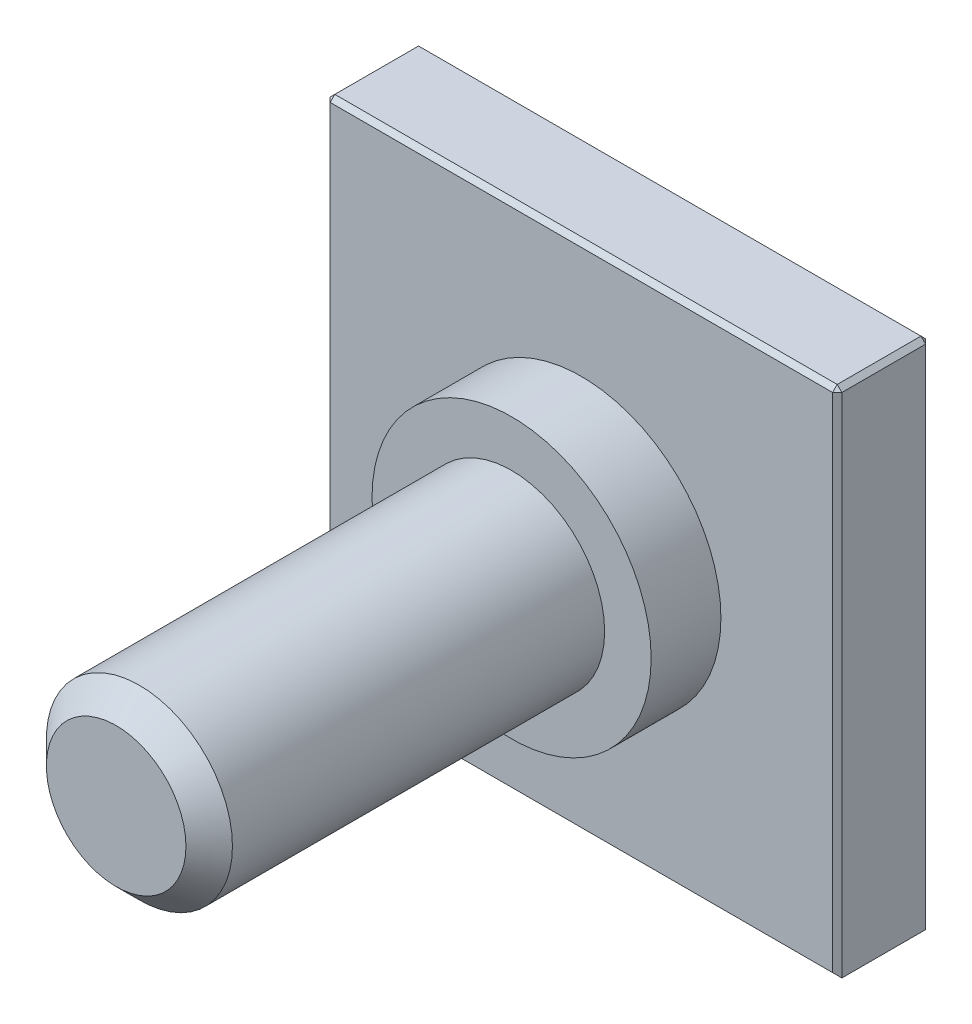
ISO-10303-21;
HEADER;
FILE_DESCRIPTION(('STEP AP214'),'2;1');
FILE_NAME('part.step','',(''),(''),'','','');
FILE_SCHEMA(('AUTOMOTIVE_DESIGN { 1 0 10303 214 1 1 1 1 }'));
ENDSEC;
DATA;
#1=APPLICATION_CONTEXT('core data for automotive mechanical design processes');
#2=APPLICATION_PROTOCOL_DEFINITION('international standard','automotive_design',2000,#1);
#3=PRODUCT_CONTEXT('',#1,'mechanical');
#4=PRODUCT('Part','Part','',(#3));
#5=PRODUCT_RELATED_PRODUCT_CATEGORY('part','',(#4));
#6=PRODUCT_DEFINITION_FORMATION('','',#4);
#7=PRODUCT_DEFINITION_CONTEXT('part definition',#1,'design');
#8=PRODUCT_DEFINITION('design','',#6,#7);
#9=PRODUCT_DEFINITION_SHAPE('','',#8);
#10=(LENGTH_UNIT() NAMED_UNIT(*) SI_UNIT(.MILLI.,.METRE.));
#11=(NAMED_UNIT(*) PLANE_ANGLE_UNIT() SI_UNIT($,.RADIAN.));
#12=(NAMED_UNIT(*) SI_UNIT($,.STERADIAN.) SOLID_ANGLE_UNIT());
#13=UNCERTAINTY_MEASURE_WITH_UNIT(LENGTH_MEASURE(1.E-05),#10,'distance_accuracy_value','');
#14=(GEOMETRIC_REPRESENTATION_CONTEXT(3) GLOBAL_UNCERTAINTY_ASSIGNED_CONTEXT((#13)) GLOBAL_UNIT_ASSIGNED_CONTEXT((#10,
#11,#12)) REPRESENTATION_CONTEXT('',''));
#15=CARTESIAN_POINT('',(0.,0.,0.));
#16=DIRECTION('',(0.,0.,1.));
#17=DIRECTION('',(1.,0.,0.));
#18=AXIS2_PLACEMENT_3D('',#15,#16,#17);
#19=CARTESIAN_POINT('',(5.5,-5.5,2.));
#20=DIRECTION('',(-1.,0.,0.));
#21=DIRECTION('',(0.,0.,1.));
#22=AXIS2_PLACEMENT_3D('',#19,#20,#21);
#23=PLANE('',#22);
#24=DIRECTION('',(0.,0.,-1.));
#25=VECTOR('',#24,1.);
#26=CARTESIAN_POINT('',(5.5,-5.5,2.));
#27=LINE('',#26,#25);
#28=CARTESIAN_POINT('',(5.5,-5.5,1.9));
#29=VERTEX_POINT('',#28);
#30=CARTESIAN_POINT('',(5.5,-5.5,0.100000000000001));
#31=VERTEX_POINT('',#30);
#32=EDGE_CURVE('E167',#29,#31,#27,.T.);
#33=ORIENTED_EDGE('',*,*,#32,.T.);
#34=DIRECTION('',(0.,1.,0.));
#35=VECTOR('',#34,1.);
#36=CARTESIAN_POINT('',(5.5,5.5,0.0999999999999994));
#37=LINE('',#36,#35);
#38=CARTESIAN_POINT('',(5.5,5.4,0.0999999999999994));
#39=VERTEX_POINT('',#38);
#40=EDGE_CURVE('E276',#31,#39,#37,.T.);
#41=ORIENTED_EDGE('',*,*,#40,.T.);
#42=DIRECTION('',(0.,0.,1.));
#43=VECTOR('',#42,1.);
#44=CARTESIAN_POINT('',(5.5,5.4,2.));
#45=LINE('',#44,#43);
#46=CARTESIAN_POINT('',(5.5,5.4,1.9));
#47=VERTEX_POINT('',#46);
#48=EDGE_CURVE('E273',#39,#47,#45,.T.);
#49=ORIENTED_EDGE('',*,*,#48,.T.);
#50=DIRECTION('',(0.,-1.,0.));
#51=VECTOR('',#50,1.);
#52=CARTESIAN_POINT('',(5.5,-5.5,1.9));
#53=LINE('',#52,#51);
#54=EDGE_CURVE('E269',#47,#29,#53,.T.);
#55=ORIENTED_EDGE('',*,*,#54,.T.);
#56=EDGE_LOOP('',(#33,#41,#49,#55));
#57=FACE_BOUND('',#56,.T.);
#58=ADVANCED_FACE('F34',(#57),#23,.F.);
#59=CARTESIAN_POINT('',(-5.5,5.5,2.));
#60=DIRECTION('',(0.,-1.,0.));
#61=DIRECTION('',(0.,0.,-1.));
#62=AXIS2_PLACEMENT_3D('',#59,#60,#61);
#63=PLANE('',#62);
#64=DIRECTION('',(1.,0.,0.));
#65=VECTOR('',#64,1.);
#66=CARTESIAN_POINT('',(-5.5,5.5,1.9));
#67=LINE('',#66,#65);
#68=CARTESIAN_POINT('',(-5.4,5.5,1.9));
#69=VERTEX_POINT('',#68);
#70=CARTESIAN_POINT('',(5.4,5.5,1.9));
#71=VERTEX_POINT('',#70);
#72=EDGE_CURVE('E120',#69,#71,#67,.T.);
#73=ORIENTED_EDGE('',*,*,#72,.T.);
#74=DIRECTION('',(0.,0.,-1.));
#75=VECTOR('',#74,1.);
#76=CARTESIAN_POINT('',(5.4,5.5,2.));
#77=LINE('',#76,#75);
#78=CARTESIAN_POINT('',(5.4,5.5,0.100000000000001));
#79=VERTEX_POINT('',#78);
#80=EDGE_CURVE('E116',#71,#79,#77,.T.);
#81=ORIENTED_EDGE('',*,*,#80,.T.);
#82=DIRECTION('',(-1.,0.,0.));
#83=VECTOR('',#82,1.);
#84=CARTESIAN_POINT('',(-5.5,5.5,0.100000000000001));
#85=LINE('',#84,#83);
#86=CARTESIAN_POINT('',(-5.4,5.5,0.100000000000001));
#87=VERTEX_POINT('',#86);
#88=EDGE_CURVE('E110',#79,#87,#85,.T.);
#89=ORIENTED_EDGE('',*,*,#88,.T.);
#90=DIRECTION('',(0.,0.,1.));
#91=VECTOR('',#90,1.);
#92=CARTESIAN_POINT('',(-5.4,5.5,2.));
#93=LINE('',#92,#91);
#94=EDGE_CURVE('E113',#87,#69,#93,.T.);
#95=ORIENTED_EDGE('',*,*,#94,.T.);
#96=EDGE_LOOP('',(#73,#81,#89,#95));
#97=FACE_BOUND('',#96,.T.);
#98=ADVANCED_FACE('F112',(#97),#63,.F.);
#99=CARTESIAN_POINT('',(-5.5,-5.5,2.));
#100=DIRECTION('',(1.,0.,0.));
#101=DIRECTION('',(0.,0.,-1.));
#102=AXIS2_PLACEMENT_3D('',#99,#100,#101);
#103=PLANE('',#102);
#104=DIRECTION('',(0.,0.,-1.));
#105=VECTOR('',#104,1.);
#106=CARTESIAN_POINT('',(-5.5,5.4,2.));
#107=LINE('',#106,#105);
#108=CARTESIAN_POINT('',(-5.5,5.4,1.9));
#109=VERTEX_POINT('',#108);
#110=CARTESIAN_POINT('',(-5.5,5.4,0.100000000000001));
#111=VERTEX_POINT('',#110);
#112=EDGE_CURVE('E49',#109,#111,#107,.T.);
#113=ORIENTED_EDGE('',*,*,#112,.T.);
#114=DIRECTION('',(0.,-1.,0.));
#115=VECTOR('',#114,1.);
#116=CARTESIAN_POINT('',(-5.5,-5.5,0.100000000000001));
#117=LINE('',#116,#115);
#118=CARTESIAN_POINT('',(-5.5,-5.5,0.100000000000001));
#119=VERTEX_POINT('',#118);
#120=EDGE_CURVE('E175',#111,#119,#117,.T.);
#121=ORIENTED_EDGE('',*,*,#120,.T.);
#122=DIRECTION('',(0.,0.,-1.));
#123=VECTOR('',#122,1.);
#124=CARTESIAN_POINT('',(-5.5,-5.5,2.));
#125=LINE('',#124,#123);
#126=CARTESIAN_POINT('',(-5.5,-5.5,1.9));
#127=VERTEX_POINT('',#126);
#128=EDGE_CURVE('E131',#127,#119,#125,.T.);
#129=ORIENTED_EDGE('',*,*,#128,.F.);
#130=DIRECTION('',(0.,1.,0.));
#131=VECTOR('',#130,1.);
#132=CARTESIAN_POINT('',(-5.5,-5.5,1.9));
#133=LINE('',#132,#131);
#134=EDGE_CURVE('E54',#127,#109,#133,.T.);
#135=ORIENTED_EDGE('',*,*,#134,.T.);
#136=EDGE_LOOP('',(#113,#121,#129,#135));
#137=FACE_BOUND('',#136,.T.);
#138=ADVANCED_FACE('F196',(#137),#103,.F.);
#139=CARTESIAN_POINT('',(-5.5,-5.5,2.));
#140=DIRECTION('',(0.,1.,0.));
#141=DIRECTION('',(0.,0.,1.));
#142=AXIS2_PLACEMENT_3D('',#139,#140,#141);
#143=PLANE('',#142);
#144=ORIENTED_EDGE('',*,*,#128,.T.);
#145=DIRECTION('',(1.,0.,0.));
#146=VECTOR('',#145,1.);
#147=CARTESIAN_POINT('',(5.5,-5.5,0.100000000000001));
#148=LINE('',#147,#146);
#149=EDGE_CURVE('E294',#119,#31,#148,.T.);
#150=ORIENTED_EDGE('',*,*,#149,.T.);
#151=ORIENTED_EDGE('',*,*,#32,.F.);
#152=DIRECTION('',(-1.,0.,0.));
#153=VECTOR('',#152,1.);
#154=CARTESIAN_POINT('',(-5.5,-5.5,1.9));
#155=LINE('',#154,#153);
#156=EDGE_CURVE('E292',#29,#127,#155,.T.);
#157=ORIENTED_EDGE('',*,*,#156,.T.);
#158=EDGE_LOOP('',(#144,#150,#151,#157));
#159=FACE_BOUND('',#158,.T.);
#160=ADVANCED_FACE('F325',(#159),#143,.F.);
#161=CARTESIAN_POINT('',(0.,0.,2.));
#162=DIRECTION('',(0.,0.,-1.));
#163=DIRECTION('',(-1.,0.,0.));
#164=AXIS2_PLACEMENT_3D('',#161,#162,#163);
#165=PLANE('',#164);
#166=CARTESIAN_POINT('',(0.,0.,2.));
#167=DIRECTION('',(0.,0.,-1.));
#168=DIRECTION('',(-1.,0.,0.));
#169=AXIS2_PLACEMENT_3D('',#166,#167,#168);
#170=CIRCLE('',#169,3.);
#171=CARTESIAN_POINT('',(-3.,0.,2.));
#172=VERTEX_POINT('',#171);
#173=EDGE_CURVE('E173',#172,#172,#170,.F.);
#174=ORIENTED_EDGE('',*,*,#173,.F.);
#175=EDGE_LOOP('',(#174));
#176=FACE_BOUND('',#175,.T.);
#177=DIRECTION('',(0.,1.,0.));
#178=VECTOR('',#177,1.);
#179=CARTESIAN_POINT('',(5.4,0.,2.));
#180=LINE('',#179,#178);
#181=CARTESIAN_POINT('',(5.4,-5.4,2.));
#182=VERTEX_POINT('',#181);
#183=CARTESIAN_POINT('',(5.4,5.4,2.));
#184=VERTEX_POINT('',#183);
#185=EDGE_CURVE('E278',#182,#184,#180,.T.);
#186=ORIENTED_EDGE('',*,*,#185,.T.);
#187=DIRECTION('',(-1.,0.,0.));
#188=VECTOR('',#187,1.);
#189=CARTESIAN_POINT('',(0.,5.4,2.));
#190=LINE('',#189,#188);
#191=CARTESIAN_POINT('',(-5.4,5.4,2.));
#192=VERTEX_POINT('',#191);
#193=EDGE_CURVE('E283',#184,#192,#190,.T.);
#194=ORIENTED_EDGE('',*,*,#193,.T.);
#195=DIRECTION('',(0.,-1.,0.));
#196=VECTOR('',#195,1.);
#197=CARTESIAN_POINT('',(-5.4,0.,2.));
#198=LINE('',#197,#196);
#199=CARTESIAN_POINT('',(-5.4,-5.4,2.));
#200=VERTEX_POINT('',#199);
#201=EDGE_CURVE('E260',#192,#200,#198,.T.);
#202=ORIENTED_EDGE('',*,*,#201,.T.);
#203=DIRECTION('',(1.,0.,0.));
#204=VECTOR('',#203,1.);
#205=CARTESIAN_POINT('',(0.,-5.4,2.));
#206=LINE('',#205,#204);
#207=EDGE_CURVE('E280',#200,#182,#206,.T.);
#208=ORIENTED_EDGE('',*,*,#207,.T.);
#209=EDGE_LOOP('',(#186,#194,#202,#208));
#210=FACE_BOUND('',#209,.T.);
#211=ADVANCED_FACE('F254',(#176,#210),#165,.F.);
#212=CARTESIAN_POINT('',(0.,0.,0.));
#213=DIRECTION('',(0.,0.,-1.));
#214=DIRECTION('',(-1.,0.,0.));
#215=AXIS2_PLACEMENT_3D('',#212,#213,#214);
#216=PLANE('',#215);
#217=DIRECTION('',(0.,1.,0.));
#218=VECTOR('',#217,1.);
#219=CARTESIAN_POINT('',(-5.4,5.5,0.));
#220=LINE('',#219,#218);
#221=CARTESIAN_POINT('',(-5.4,-5.4,0.));
#222=VERTEX_POINT('',#221);
#223=CARTESIAN_POINT('',(-5.4,5.4,0.));
#224=VERTEX_POINT('',#223);
#225=EDGE_CURVE('E285',#222,#224,#220,.T.);
#226=ORIENTED_EDGE('',*,*,#225,.T.);
#227=DIRECTION('',(1.,0.,0.));
#228=VECTOR('',#227,1.);
#229=CARTESIAN_POINT('',(5.5,5.4,0.));
#230=LINE('',#229,#228);
#231=CARTESIAN_POINT('',(5.4,5.4,0.));
#232=VERTEX_POINT('',#231);
#233=EDGE_CURVE('E143',#224,#232,#230,.T.);
#234=ORIENTED_EDGE('',*,*,#233,.T.);
#235=DIRECTION('',(0.,-1.,0.));
#236=VECTOR('',#235,1.);
#237=CARTESIAN_POINT('',(5.4,-5.5,0.));
#238=LINE('',#237,#236);
#239=CARTESIAN_POINT('',(5.4,-5.4,0.));
#240=VERTEX_POINT('',#239);
#241=EDGE_CURVE('E289',#232,#240,#238,.T.);
#242=ORIENTED_EDGE('',*,*,#241,.T.);
#243=DIRECTION('',(-1.,0.,0.));
#244=VECTOR('',#243,1.);
#245=CARTESIAN_POINT('',(-5.5,-5.4,0.));
#246=LINE('',#245,#244);
#247=EDGE_CURVE('E287',#240,#222,#246,.T.);
#248=ORIENTED_EDGE('',*,*,#247,.T.);
#249=EDGE_LOOP('',(#226,#234,#242,#248));
#250=FACE_BOUND('',#249,.T.);
#251=ADVANCED_FACE('F249',(#250),#216,.T.);
#252=CARTESIAN_POINT('',(-5.4,0.,2.));
#253=DIRECTION('',(0.707106781186541,0.,-0.707106781186554));
#254=DIRECTION('',(0.,-1.,0.));
#255=AXIS2_PLACEMENT_3D('',#252,#253,#254);
#256=PLANE('',#255);
#257=DIRECTION('',(-0.707106781186554,0.,-0.707106781186541));
#258=VECTOR('',#257,1.);
#259=CARTESIAN_POINT('',(-5.4,5.4,2.));
#260=LINE('',#259,#258);
#261=EDGE_CURVE('E161',#109,#192,#260,.F.);
#262=ORIENTED_EDGE('',*,*,#261,.F.);
#263=ORIENTED_EDGE('',*,*,#134,.F.);
#264=DIRECTION('',(-0.577350269189629,-0.577350269189629,-0.577350269189619));
#265=VECTOR('',#264,1.);
#266=CARTESIAN_POINT('',(-3.59999999999998,-3.59999999999998,3.79999999999999));
#267=LINE('',#266,#265);
#268=EDGE_CURVE('E164',#200,#127,#267,.T.);
#269=ORIENTED_EDGE('',*,*,#268,.F.);
#270=ORIENTED_EDGE('',*,*,#201,.F.);
#271=EDGE_LOOP('',(#262,#263,#269,#270));
#272=FACE_BOUND('',#271,.T.);
#273=ADVANCED_FACE('F247',(#272),#256,.F.);
#274=CARTESIAN_POINT('',(-5.5,5.4,2.));
#275=DIRECTION('',(0.707106781186551,-0.707106781186544,0.));
#276=DIRECTION('',(0.,0.,-1.));
#277=AXIS2_PLACEMENT_3D('',#274,#275,#276);
#278=PLANE('',#277);
#279=DIRECTION('',(-0.707106781186544,-0.707106781186551,0.));
#280=VECTOR('',#279,1.);
#281=CARTESIAN_POINT('',(-5.4,5.5,0.100000000000001));
#282=LINE('',#281,#280);
#283=EDGE_CURVE('E126',#111,#87,#282,.F.);
#284=ORIENTED_EDGE('',*,*,#283,.F.);
#285=ORIENTED_EDGE('',*,*,#112,.F.);
#286=DIRECTION('',(0.707106781186544,0.707106781186551,0.));
#287=VECTOR('',#286,1.);
#288=CARTESIAN_POINT('',(-5.45,5.45,1.9));
#289=LINE('',#288,#287);
#290=EDGE_CURVE('E129',#69,#109,#289,.F.);
#291=ORIENTED_EDGE('',*,*,#290,.F.);
#292=ORIENTED_EDGE('',*,*,#94,.F.);
#293=EDGE_LOOP('',(#284,#285,#291,#292));
#294=FACE_BOUND('',#293,.T.);
#295=ADVANCED_FACE('F125',(#294),#278,.F.);
#296=CARTESIAN_POINT('',(-5.5,-5.5,0.100000000000001));
#297=DIRECTION('',(-0.707106781186554,0.,-0.707106781186541));
#298=DIRECTION('',(0.,1.,0.));
#299=AXIS2_PLACEMENT_3D('',#296,#297,#298);
#300=PLANE('',#299);
#301=DIRECTION('',(-0.577350269189622,-0.577350269189622,0.577350269189632));
#302=VECTOR('',#301,1.);
#303=CARTESIAN_POINT('',(-5.5,-5.5,0.100000000000001));
#304=LINE('',#303,#302);
#305=EDGE_CURVE('E156',#119,#222,#304,.F.);
#306=ORIENTED_EDGE('',*,*,#305,.F.);
#307=ORIENTED_EDGE('',*,*,#120,.F.);
#308=DIRECTION('',(-0.707106781186541,0.,0.707106781186554));
#309=VECTOR('',#308,1.);
#310=CARTESIAN_POINT('',(-5.45,5.4,0.050000000000001));
#311=LINE('',#310,#309);
#312=EDGE_CURVE('E139',#224,#111,#311,.T.);
#313=ORIENTED_EDGE('',*,*,#312,.F.);
#314=ORIENTED_EDGE('',*,*,#225,.F.);
#315=EDGE_LOOP('',(#306,#307,#313,#314));
#316=FACE_BOUND('',#315,.T.);
#317=ADVANCED_FACE('F241',(#316),#300,.T.);
#318=CARTESIAN_POINT('',(0.,-5.4,2.));
#319=DIRECTION('',(0.,0.707106781186541,-0.707106781186554));
#320=DIRECTION('',(1.,0.,0.));
#321=AXIS2_PLACEMENT_3D('',#318,#319,#320);
#322=PLANE('',#321);
#323=ORIENTED_EDGE('',*,*,#268,.T.);
#324=ORIENTED_EDGE('',*,*,#156,.F.);
#325=DIRECTION('',(0.577350269189629,-0.577350269189629,-0.577350269189619));
#326=VECTOR('',#325,1.);
#327=CARTESIAN_POINT('',(3.59999999999998,-3.59999999999998,3.79999999999999));
#328=LINE('',#327,#326);
#329=EDGE_CURVE('E147',#182,#29,#328,.T.);
#330=ORIENTED_EDGE('',*,*,#329,.F.);
#331=ORIENTED_EDGE('',*,*,#207,.F.);
#332=EDGE_LOOP('',(#323,#324,#330,#331));
#333=FACE_BOUND('',#332,.T.);
#334=ADVANCED_FACE('F237',(#333),#322,.F.);
#335=CARTESIAN_POINT('',(-5.4,5.4,2.));
#336=DIRECTION('',(-0.577350269189623,0.577350269189617,0.577350269189637));
#337=DIRECTION('',(0.707106781186557,0.,0.707106781186538));
#338=AXIS2_PLACEMENT_3D('',#335,#336,#337);
#339=PLANE('',#338);
#340=ORIENTED_EDGE('',*,*,#290,.T.);
#341=ORIENTED_EDGE('',*,*,#261,.T.);
#342=DIRECTION('',(0.,-0.707106781186554,0.707106781186541));
#343=VECTOR('',#342,1.);
#344=CARTESIAN_POINT('',(-5.4,5.4,2.));
#345=LINE('',#344,#343);
#346=EDGE_CURVE('E144',#69,#192,#345,.T.);
#347=ORIENTED_EDGE('',*,*,#346,.F.);
#348=EDGE_LOOP('',(#340,#341,#347));
#349=FACE_BOUND('',#348,.T.);
#350=ADVANCED_FACE('F234',(#349),#339,.T.);
#351=CARTESIAN_POINT('',(-5.4,5.5,0.100000000000001));
#352=DIRECTION('',(-0.577350269189632,0.577350269189627,-0.577350269189617));
#353=DIRECTION('',(-0.707106781186544,-0.707106781186551,0.));
#354=AXIS2_PLACEMENT_3D('',#351,#352,#353);
#355=PLANE('',#354);
#356=ORIENTED_EDGE('',*,*,#312,.T.);
#357=ORIENTED_EDGE('',*,*,#283,.T.);
#358=DIRECTION('',(0.,-0.707106781186541,-0.707106781186554));
#359=VECTOR('',#358,1.);
#360=CARTESIAN_POINT('',(-5.4,5.5,0.100000000000001));
#361=LINE('',#360,#359);
#362=EDGE_CURVE('E136',#224,#87,#361,.F.);
#363=ORIENTED_EDGE('',*,*,#362,.F.);
#364=EDGE_LOOP('',(#356,#357,#363));
#365=FACE_BOUND('',#364,.T.);
#366=ADVANCED_FACE('F135',(#365),#355,.T.);
#367=CARTESIAN_POINT('',(-5.5,-5.5,0.100000000000001));
#368=DIRECTION('',(0.,-0.707106781186554,-0.707106781186541));
#369=DIRECTION('',(-1.,0.,0.));
#370=AXIS2_PLACEMENT_3D('',#367,#368,#369);
#371=PLANE('',#370);
#372=ORIENTED_EDGE('',*,*,#305,.T.);
#373=ORIENTED_EDGE('',*,*,#247,.F.);
#374=DIRECTION('',(0.577350269189636,-0.577350269189616,0.577350269189626));
#375=VECTOR('',#374,1.);
#376=CARTESIAN_POINT('',(1.83333333333321,-1.83333333333333,-3.56666666666673));
#377=LINE('',#376,#375);
#378=EDGE_CURVE('E145',#31,#240,#377,.F.);
#379=ORIENTED_EDGE('',*,*,#378,.F.);
#380=ORIENTED_EDGE('',*,*,#149,.F.);
#381=EDGE_LOOP('',(#372,#373,#379,#380));
#382=FACE_BOUND('',#381,.T.);
#383=ADVANCED_FACE('F227',(#382),#371,.T.);
#384=CARTESIAN_POINT('',(5.4,0.,2.));
#385=DIRECTION('',(-0.707106781186541,0.,-0.707106781186554));
#386=DIRECTION('',(0.,1.,0.));
#387=AXIS2_PLACEMENT_3D('',#384,#385,#386);
#388=PLANE('',#387);
#389=ORIENTED_EDGE('',*,*,#329,.T.);
#390=ORIENTED_EDGE('',*,*,#54,.F.);
#391=DIRECTION('',(-0.707106781186554,0.,0.707106781186541));
#392=VECTOR('',#391,1.);
#393=CARTESIAN_POINT('',(5.5,5.4,1.9));
#394=LINE('',#393,#392);
#395=EDGE_CURVE('E150',#184,#47,#394,.F.);
#396=ORIENTED_EDGE('',*,*,#395,.F.);
#397=ORIENTED_EDGE('',*,*,#185,.F.);
#398=EDGE_LOOP('',(#389,#390,#396,#397));
#399=FACE_BOUND('',#398,.T.);
#400=ADVANCED_FACE('F223',(#399),#388,.F.);
#401=CARTESIAN_POINT('',(0.,5.4,2.));
#402=DIRECTION('',(0.,-0.707106781186541,-0.707106781186554));
#403=DIRECTION('',(-1.,0.,0.));
#404=AXIS2_PLACEMENT_3D('',#401,#402,#403);
#405=PLANE('',#404);
#406=ORIENTED_EDGE('',*,*,#346,.T.);
#407=ORIENTED_EDGE('',*,*,#193,.F.);
#408=DIRECTION('',(0.,0.707106781186554,-0.707106781186541));
#409=VECTOR('',#408,1.);
#410=CARTESIAN_POINT('',(5.4,5.45,1.95));
#411=LINE('',#410,#409);
#412=EDGE_CURVE('E266',#71,#184,#411,.F.);
#413=ORIENTED_EDGE('',*,*,#412,.F.);
#414=ORIENTED_EDGE('',*,*,#72,.F.);
#415=EDGE_LOOP('',(#406,#407,#413,#414));
#416=FACE_BOUND('',#415,.T.);
#417=ADVANCED_FACE('F220',(#416),#405,.F.);
#418=CARTESIAN_POINT('',(-5.5,5.5,0.100000000000001));
#419=DIRECTION('',(0.,0.707106781186554,-0.707106781186541));
#420=DIRECTION('',(1.,0.,0.));
#421=AXIS2_PLACEMENT_3D('',#418,#419,#420);
#422=PLANE('',#421);
#423=ORIENTED_EDGE('',*,*,#362,.T.);
#424=ORIENTED_EDGE('',*,*,#88,.F.);
#425=DIRECTION('',(0.,0.707106781186541,0.707106781186554));
#426=VECTOR('',#425,1.);
#427=CARTESIAN_POINT('',(5.4,5.5,0.100000000000001));
#428=LINE('',#427,#426);
#429=EDGE_CURVE('E304',#232,#79,#428,.T.);
#430=ORIENTED_EDGE('',*,*,#429,.F.);
#431=ORIENTED_EDGE('',*,*,#233,.F.);
#432=EDGE_LOOP('',(#423,#424,#430,#431));
#433=FACE_BOUND('',#432,.T.);
#434=ADVANCED_FACE('F141',(#433),#422,.T.);
#435=CARTESIAN_POINT('',(5.5,-5.5,0.0999999999999994));
#436=DIRECTION('',(0.707106781186541,0.,-0.707106781186554));
#437=DIRECTION('',(0.,-1.,0.));
#438=AXIS2_PLACEMENT_3D('',#435,#436,#437);
#439=PLANE('',#438);
#440=ORIENTED_EDGE('',*,*,#378,.T.);
#441=ORIENTED_EDGE('',*,*,#241,.F.);
#442=DIRECTION('',(-0.707106781186554,0.,-0.707106781186541));
#443=VECTOR('',#442,1.);
#444=CARTESIAN_POINT('',(5.45,5.4,0.0499999999999993));
#445=LINE('',#444,#443);
#446=EDGE_CURVE('E302',#39,#232,#445,.T.);
#447=ORIENTED_EDGE('',*,*,#446,.F.);
#448=ORIENTED_EDGE('',*,*,#40,.F.);
#449=EDGE_LOOP('',(#440,#441,#447,#448));
#450=FACE_BOUND('',#449,.T.);
#451=ADVANCED_FACE('F213',(#450),#439,.T.);
#452=CARTESIAN_POINT('',(5.5,5.4,1.9));
#453=DIRECTION('',(0.577350269189619,0.577350269189624,0.577350269189634));
#454=DIRECTION('',(0.,-0.707106781186554,0.707106781186541));
#455=AXIS2_PLACEMENT_3D('',#452,#453,#454);
#456=PLANE('',#455);
#457=ORIENTED_EDGE('',*,*,#412,.T.);
#458=ORIENTED_EDGE('',*,*,#395,.T.);
#459=DIRECTION('',(0.70710678118655,-0.707106781186544,0.));
#460=VECTOR('',#459,1.);
#461=CARTESIAN_POINT('',(5.5,5.4,1.9));
#462=LINE('',#461,#460);
#463=EDGE_CURVE('E300',#71,#47,#462,.T.);
#464=ORIENTED_EDGE('',*,*,#463,.F.);
#465=EDGE_LOOP('',(#457,#458,#464));
#466=FACE_BOUND('',#465,.T.);
#467=ADVANCED_FACE('F209',(#466),#456,.T.);
#468=CARTESIAN_POINT('',(5.4,5.5,0.100000000000001));
#469=DIRECTION('',(0.577350269189619,0.577350269189634,-0.577350269189624));
#470=DIRECTION('',(0.,0.707106781186541,0.707106781186554));
#471=AXIS2_PLACEMENT_3D('',#468,#469,#470);
#472=PLANE('',#471);
#473=ORIENTED_EDGE('',*,*,#446,.T.);
#474=ORIENTED_EDGE('',*,*,#429,.T.);
#475=DIRECTION('',(-0.707106781186551,0.707106781186544,0.));
#476=VECTOR('',#475,1.);
#477=CARTESIAN_POINT('',(5.4,5.5,0.100000000000001));
#478=LINE('',#477,#476);
#479=EDGE_CURVE('E171',#39,#79,#478,.T.);
#480=ORIENTED_EDGE('',*,*,#479,.F.);
#481=EDGE_LOOP('',(#473,#474,#480));
#482=FACE_BOUND('',#481,.T.);
#483=ADVANCED_FACE('F205',(#482),#472,.T.);
#484=CARTESIAN_POINT('',(5.4,5.5,2.));
#485=DIRECTION('',(-0.707106781186544,-0.707106781186551,0.));
#486=DIRECTION('',(0.,0.,-1.));
#487=AXIS2_PLACEMENT_3D('',#484,#485,#486);
#488=PLANE('',#487);
#489=ORIENTED_EDGE('',*,*,#463,.T.);
#490=ORIENTED_EDGE('',*,*,#48,.F.);
#491=ORIENTED_EDGE('',*,*,#479,.T.);
#492=ORIENTED_EDGE('',*,*,#80,.F.);
#493=EDGE_LOOP('',(#489,#490,#491,#492));
#494=FACE_BOUND('',#493,.T.);
#495=ADVANCED_FACE('F201',(#494),#488,.F.);
#496=CARTESIAN_POINT('',(0.,0.,3.5));
#497=DIRECTION('',(0.,0.,-1.));
#498=DIRECTION('',(-1.,0.,0.));
#499=AXIS2_PLACEMENT_3D('',#496,#497,#498);
#500=CYLINDRICAL_SURFACE('',#499,3.);
#501=CARTESIAN_POINT('',(0.,0.,3.5));
#502=DIRECTION('',(0.,0.,1.));
#503=DIRECTION('',(1.,0.,0.));
#504=AXIS2_PLACEMENT_3D('',#501,#502,#503);
#505=CIRCLE('',#504,3.);
#506=CARTESIAN_POINT('',(3.,0.,3.5));
#507=VERTEX_POINT('',#506);
#508=EDGE_CURVE('E172',#507,#507,#505,.T.);
#509=ORIENTED_EDGE('',*,*,#508,.F.);
#510=EDGE_LOOP('',(#509));
#511=FACE_BOUND('',#510,.T.);
#512=ORIENTED_EDGE('',*,*,#173,.T.);
#513=EDGE_LOOP('',(#512));
#514=FACE_BOUND('',#513,.T.);
#515=ADVANCED_FACE('F204',(#511,#514),#500,.T.);
#516=CARTESIAN_POINT('',(0.,0.,3.5));
#517=DIRECTION('',(0.,0.,1.));
#518=DIRECTION('',(1.,0.,0.));
#519=AXIS2_PLACEMENT_3D('',#516,#517,#518);
#520=PLANE('',#519);
#521=CARTESIAN_POINT('',(0.,0.,3.5));
#522=DIRECTION('',(0.,0.,1.));
#523=DIRECTION('',(1.,0.,0.));
#524=AXIS2_PLACEMENT_3D('',#521,#522,#523);
#525=CIRCLE('',#524,2.);
#526=CARTESIAN_POINT('',(2.,0.,3.5));
#527=VERTEX_POINT('',#526);
#528=EDGE_CURVE('E168',#527,#527,#525,.T.);
#529=ORIENTED_EDGE('',*,*,#528,.F.);
#530=EDGE_LOOP('',(#529));
#531=FACE_BOUND('',#530,.T.);
#532=ORIENTED_EDGE('',*,*,#508,.T.);
#533=EDGE_LOOP('',(#532));
#534=FACE_BOUND('',#533,.T.);
#535=ADVANCED_FACE('F333',(#531,#534),#520,.T.);
#536=CARTESIAN_POINT('',(0.,0.,12.));
#537=DIRECTION('',(0.,0.,1.));
#538=DIRECTION('',(1.,0.,0.));
#539=AXIS2_PLACEMENT_3D('',#536,#537,#538);
#540=PLANE('',#539);
#541=CARTESIAN_POINT('',(0.,0.,12.));
#542=DIRECTION('',(0.,0.,1.));
#543=DIRECTION('',(1.,0.,0.));
#544=AXIS2_PLACEMENT_3D('',#541,#542,#543);
#545=CIRCLE('',#544,1.5);
#546=CARTESIAN_POINT('',(1.5,0.,12.));
#547=VERTEX_POINT('',#546);
#548=EDGE_CURVE('E42',#547,#547,#545,.T.);
#549=ORIENTED_EDGE('',*,*,#548,.T.);
#550=EDGE_LOOP('',(#549));
#551=FACE_BOUND('',#550,.T.);
#552=ADVANCED_FACE('F179',(#551),#540,.T.);
#553=CARTESIAN_POINT('',(0.,0.,12.));
#554=DIRECTION('',(0.,0.,-1.));
#555=DIRECTION('',(-1.,0.,0.));
#556=AXIS2_PLACEMENT_3D('',#553,#554,#555);
#557=CYLINDRICAL_SURFACE('',#556,2.);
#558=CARTESIAN_POINT('',(0.,0.,11.5));
#559=DIRECTION('',(0.,0.,1.));
#560=DIRECTION('',(1.,0.,0.));
#561=AXIS2_PLACEMENT_3D('',#558,#559,#560);
#562=CIRCLE('',#561,2.);
#563=CARTESIAN_POINT('',(2.,0.,11.5));
#564=VERTEX_POINT('',#563);
#565=EDGE_CURVE('E11',#564,#564,#562,.F.);
#566=ORIENTED_EDGE('',*,*,#565,.T.);
#567=EDGE_LOOP('',(#566));
#568=FACE_BOUND('',#567,.T.);
#569=ORIENTED_EDGE('',*,*,#528,.T.);
#570=EDGE_LOOP('',(#569));
#571=FACE_BOUND('',#570,.T.);
#572=ADVANCED_FACE('F182',(#568,#571),#557,.T.);
#573=CARTESIAN_POINT('',(0.,0.,12.));
#574=DIRECTION('',(0.,0.,-1.));
#575=DIRECTION('',(-1.,0.,0.));
#576=AXIS2_PLACEMENT_3D('',#573,#574,#575);
#577=CONICAL_SURFACE('',#576,1.5,0.785398163397447);
#578=ORIENTED_EDGE('',*,*,#565,.F.);
#579=EDGE_LOOP('',(#578));
#580=FACE_BOUND('',#579,.T.);
#581=ORIENTED_EDGE('',*,*,#548,.F.);
#582=EDGE_LOOP('',(#581));
#583=FACE_BOUND('',#582,.T.);
#584=ADVANCED_FACE('F36',(#580,#583),#577,.T.);
#585=CLOSED_SHELL('',(#58,#98,#138,#160,#211,#251,#273,#295,#317,#334,#350,#366,#383,#400,#417,
#434,#451,#467,#483,#495,#515,#535,#552,#572,#584));
#586=MANIFOLD_SOLID_BREP('B2',#585);
#587=ADVANCED_BREP_SHAPE_REPRESENTATION('',(#18,#586),#14);
#588=SHAPE_DEFINITION_REPRESENTATION(#9,#587);
ENDSEC;
END-ISO-10303-21;
